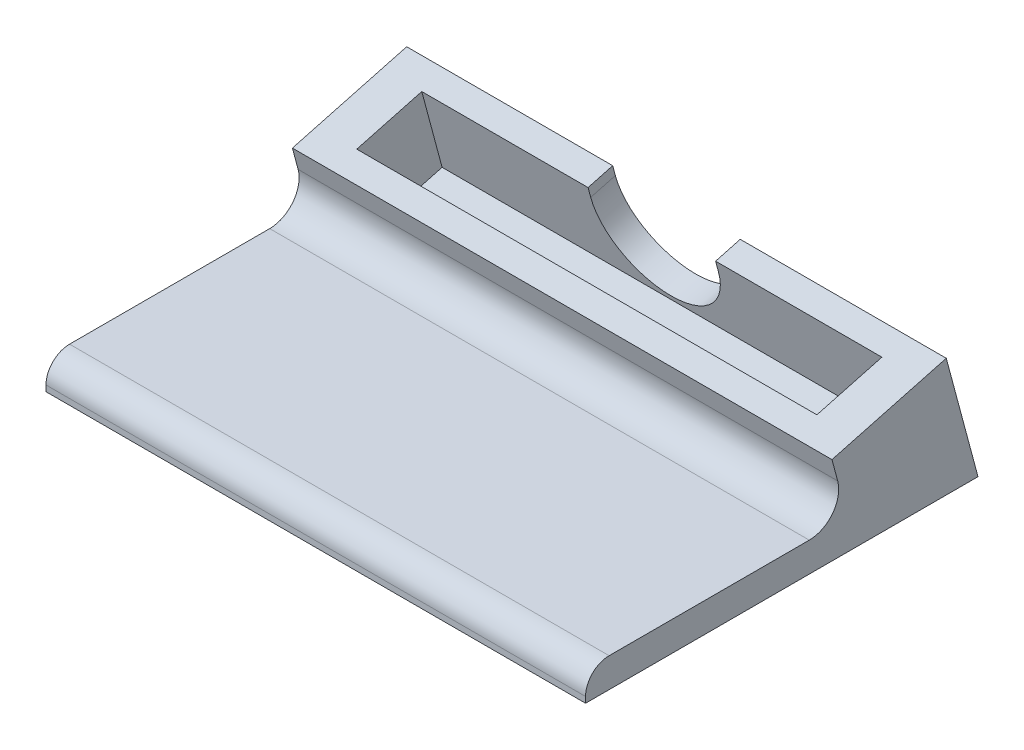
ISO-10303-21;
HEADER;
FILE_DESCRIPTION(('STEP AP214'),'2;1');
FILE_NAME('part.step','',(''),(''),'','','');
FILE_SCHEMA(('AUTOMOTIVE_DESIGN { 1 0 10303 214 1 1 1 1 }'));
ENDSEC;
DATA;
#1=APPLICATION_CONTEXT('core data for automotive mechanical design processes');
#2=APPLICATION_PROTOCOL_DEFINITION('international standard','automotive_design',2000,#1);
#3=PRODUCT_CONTEXT('',#1,'mechanical');
#4=PRODUCT('Part','Part','',(#3));
#5=PRODUCT_RELATED_PRODUCT_CATEGORY('part','',(#4));
#6=PRODUCT_DEFINITION_FORMATION('','',#4);
#7=PRODUCT_DEFINITION_CONTEXT('part definition',#1,'design');
#8=PRODUCT_DEFINITION('design','',#6,#7);
#9=PRODUCT_DEFINITION_SHAPE('','',#8);
#10=(LENGTH_UNIT() NAMED_UNIT(*) SI_UNIT(.MILLI.,.METRE.));
#11=(NAMED_UNIT(*) PLANE_ANGLE_UNIT() SI_UNIT($,.RADIAN.));
#12=(NAMED_UNIT(*) SI_UNIT($,.STERADIAN.) SOLID_ANGLE_UNIT());
#13=UNCERTAINTY_MEASURE_WITH_UNIT(LENGTH_MEASURE(1.E-05),#10,'distance_accuracy_value','');
#14=(GEOMETRIC_REPRESENTATION_CONTEXT(3) GLOBAL_UNCERTAINTY_ASSIGNED_CONTEXT((#13)) GLOBAL_UNIT_ASSIGNED_CONTEXT((#10,
#11,#12)) REPRESENTATION_CONTEXT('',''));
#15=CARTESIAN_POINT('',(0.,0.,0.));
#16=DIRECTION('',(0.,0.,1.));
#17=DIRECTION('',(1.,0.,0.));
#18=AXIS2_PLACEMENT_3D('',#15,#16,#17);
#19=CARTESIAN_POINT('',(0.,2.63407249233927,0.705797597127319));
#20=DIRECTION('',(0.,0.96592582628907,0.258819045102515));
#21=DIRECTION('',(0.,-0.258819045102515,0.96592582628907));
#22=AXIS2_PLACEMENT_3D('',#19,#20,#21);
#23=PLANE('',#22);
#24=DIRECTION('',(1.,0.,0.));
#25=VECTOR('',#24,1.);
#26=CARTESIAN_POINT('',(0.,15.334072492339,-46.6912476589975));
#27=LINE('',#26,#25);
#28=CARTESIAN_POINT('',(43.17999875,15.334072492339,-46.6912476589976));
#29=VERTEX_POINT('',#28);
#30=CARTESIAN_POINT('',(69.85,15.334072492339,-46.6912476589976));
#31=VERTEX_POINT('',#30);
#32=EDGE_CURVE('E228',#29,#31,#27,.T.);
#33=ORIENTED_EDGE('',*,*,#32,.F.);
#34=DIRECTION('',(0.,0.258819045102515,-0.96592582628907));
#35=VECTOR('',#34,1.);
#36=CARTESIAN_POINT('',(43.17999875,2.63373167087538,0.707069560146857));
#37=LINE('',#36,#35);
#38=CARTESIAN_POINT('',(43.17999875,14.4794520054105,-43.501760580591));
#39=VERTEX_POINT('',#38);
#40=EDGE_CURVE('E180',#39,#29,#37,.T.);
#41=ORIENTED_EDGE('',*,*,#40,.F.);
#42=DIRECTION('',(-1.,0.,0.));
#43=VECTOR('',#42,1.);
#44=CARTESIAN_POINT('',(5.14349999999995,14.4794520054105,-43.501760580591));
#45=LINE('',#44,#43);
#46=CARTESIAN_POINT('',(64.7065,14.4794520054105,-43.501760580591));
#47=VERTEX_POINT('',#46);
#48=EDGE_CURVE('E187',#47,#39,#45,.T.);
#49=ORIENTED_EDGE('',*,*,#48,.F.);
#50=DIRECTION('',(0.,0.258819045102514,-0.96592582628907));
#51=VECTOR('',#50,1.);
#52=CARTESIAN_POINT('',(64.7065,14.4794520054105,-43.501760580591));
#53=LINE('',#52,#51);
#54=CARTESIAN_POINT('',(64.7065,12.2245687206683,-35.0864215967954));
#55=VERTEX_POINT('',#54);
#56=EDGE_CURVE('E201',#55,#47,#53,.T.);
#57=ORIENTED_EDGE('',*,*,#56,.F.);
#58=DIRECTION('',(1.,0.,0.));
#59=VECTOR('',#58,1.);
#60=CARTESIAN_POINT('',(5.14349999999995,12.2245687206683,-35.0864215967954));
#61=LINE('',#60,#59);
#62=CARTESIAN_POINT('',(5.14349999999995,12.2245687206683,-35.0864215967954));
#63=VERTEX_POINT('',#62);
#64=EDGE_CURVE('E198',#63,#55,#61,.T.);
#65=ORIENTED_EDGE('',*,*,#64,.F.);
#66=DIRECTION('',(0.,-0.258819045102515,0.96592582628907));
#67=VECTOR('',#66,1.);
#68=CARTESIAN_POINT('',(5.14349999999995,14.4794520054105,-43.501760580591));
#69=LINE('',#68,#67);
#70=CARTESIAN_POINT('',(5.14349999999995,14.4794520054105,-43.501760580591));
#71=VERTEX_POINT('',#70);
#72=EDGE_CURVE('E165',#71,#63,#69,.T.);
#73=ORIENTED_EDGE('',*,*,#72,.F.);
#74=CARTESIAN_POINT('',(26.66999875,14.4794520054105,-43.501760580591));
#75=VERTEX_POINT('',#74);
#76=EDGE_CURVE('E204',#75,#71,#45,.T.);
#77=ORIENTED_EDGE('',*,*,#76,.F.);
#78=DIRECTION('',(0.,0.258819045102515,-0.96592582628907));
#79=VECTOR('',#78,1.);
#80=CARTESIAN_POINT('',(26.66999875,2.63373167087538,0.707069560146871));
#81=LINE('',#80,#79);
#82=CARTESIAN_POINT('',(26.66999875,15.334072492339,-46.6912476589976));
#83=VERTEX_POINT('',#82);
#84=EDGE_CURVE('E156',#75,#83,#81,.T.);
#85=ORIENTED_EDGE('',*,*,#84,.T.);
#86=CARTESIAN_POINT('',(0.,15.334072492339,-46.6912476589975));
#87=VERTEX_POINT('',#86);
#88=EDGE_CURVE('E224',#87,#83,#27,.T.);
#89=ORIENTED_EDGE('',*,*,#88,.F.);
#90=DIRECTION('',(0.,-0.258819045102515,0.96592582628907));
#91=VECTOR('',#90,1.);
#92=CARTESIAN_POINT('',(0.,2.63407249233927,0.705797597127319));
#93=LINE('',#92,#91);
#94=CARTESIAN_POINT('',(0.,11.3699482337398,-31.8969345183889));
#95=VERTEX_POINT('',#94);
#96=EDGE_CURVE('E216',#87,#95,#93,.T.);
#97=ORIENTED_EDGE('',*,*,#96,.T.);
#98=DIRECTION('',(1.,0.,0.));
#99=VECTOR('',#98,1.);
#100=CARTESIAN_POINT('',(0.,11.3699482337398,-31.8969345183889));
#101=LINE('',#100,#99);
#102=CARTESIAN_POINT('',(69.85,11.3699482337398,-31.8969345183889));
#103=VERTEX_POINT('',#102);
#104=EDGE_CURVE('E229',#95,#103,#101,.T.);
#105=ORIENTED_EDGE('',*,*,#104,.T.);
#106=DIRECTION('',(0.,-0.258819045102515,0.96592582628907));
#107=VECTOR('',#106,1.);
#108=CARTESIAN_POINT('',(69.85,2.63407249233927,0.705797597127281));
#109=LINE('',#108,#107);
#110=EDGE_CURVE('E209',#31,#103,#109,.T.);
#111=ORIENTED_EDGE('',*,*,#110,.F.);
#112=EDGE_LOOP('',(#33,#41,#49,#57,#65,#73,#77,#85,#89,#97,#105,#111));
#113=FACE_BOUND('',#112,.T.);
#114=ADVANCED_FACE('F35',(#113),#23,.T.);
#115=CARTESIAN_POINT('',(0.,12.6999999999997,-47.3970452561249));
#116=DIRECTION('',(0.,0.258819045102515,-0.96592582628907));
#117=DIRECTION('',(0.,0.96592582628907,0.258819045102515));
#118=AXIS2_PLACEMENT_3D('',#115,#116,#117);
#119=PLANE('',#118);
#120=CARTESIAN_POINT('',(34.92499875,14.0582776609764,-47.033095853769));
#121=DIRECTION('',(0.,0.258819045102515,-0.96592582628907));
#122=DIRECTION('',(0.,0.96592582628907,0.258819045102515));
#123=AXIS2_PLACEMENT_3D('',#120,#121,#122);
#124=CIRCLE('',#123,8.255);
#125=CARTESIAN_POINT('',(43.17999875,14.0582776609764,-47.033095853769));
#126=VERTEX_POINT('',#125);
#127=CARTESIAN_POINT('',(26.66999875,14.0582776609764,-47.033095853769));
#128=VERTEX_POINT('',#127);
#129=EDGE_CURVE('E153',#126,#128,#124,.T.);
#130=ORIENTED_EDGE('',*,*,#129,.F.);
#131=DIRECTION('',(0.,0.96592582628907,0.258819045102515));
#132=VECTOR('',#131,1.);
#133=CARTESIAN_POINT('',(43.17999875,12.6999999999997,-47.3970452561249));
#134=LINE('',#133,#132);
#135=EDGE_CURVE('E157',#126,#29,#134,.T.);
#136=ORIENTED_EDGE('',*,*,#135,.T.);
#137=ORIENTED_EDGE('',*,*,#32,.T.);
#138=DIRECTION('',(0.,0.96592582628907,0.258819045102515));
#139=VECTOR('',#138,1.);
#140=CARTESIAN_POINT('',(69.85,12.6999999999997,-47.3970452561249));
#141=LINE('',#140,#139);
#142=CARTESIAN_POINT('',(69.85,0.,-50.8));
#143=VERTEX_POINT('',#142);
#144=EDGE_CURVE('E220',#143,#31,#141,.T.);
#145=ORIENTED_EDGE('',*,*,#144,.F.);
#146=DIRECTION('',(-1.,0.,0.));
#147=VECTOR('',#146,1.);
#148=CARTESIAN_POINT('',(0.,0.,-50.8));
#149=LINE('',#148,#147);
#150=CARTESIAN_POINT('',(-2.50000002775557E-06,0.,-50.8));
#151=VERTEX_POINT('',#150);
#152=EDGE_CURVE('E242',#143,#151,#149,.T.);
#153=ORIENTED_EDGE('',*,*,#152,.T.);
#154=DIRECTION('',(0.,0.96592582628907,0.258819045102515));
#155=VECTOR('',#154,1.);
#156=CARTESIAN_POINT('',(0.,12.6999999999997,-47.3970452561249));
#157=LINE('',#156,#155);
#158=EDGE_CURVE('E231',#151,#87,#157,.T.);
#159=ORIENTED_EDGE('',*,*,#158,.T.);
#160=ORIENTED_EDGE('',*,*,#88,.T.);
#161=DIRECTION('',(0.,0.96592582628907,0.258819045102515));
#162=VECTOR('',#161,1.);
#163=CARTESIAN_POINT('',(26.66999875,12.6999999999997,-47.3970452561249));
#164=LINE('',#163,#162);
#165=EDGE_CURVE('E175',#128,#83,#164,.T.);
#166=ORIENTED_EDGE('',*,*,#165,.F.);
#167=EDGE_LOOP('',(#130,#136,#137,#145,#153,#159,#160,#166));
#168=FACE_BOUND('',#167,.T.);
#169=ADVANCED_FACE('F283',(#168),#119,.T.);
#170=CARTESIAN_POINT('',(5.14349999999995,4.66564561031352,-46.1313620788326));
#171=DIRECTION('',(0.,0.258819045102515,-0.96592582628907));
#172=DIRECTION('',(0.,0.96592582628907,0.258819045102515));
#173=AXIS2_PLACEMENT_3D('',#170,#171,#172);
#174=PLANE('',#173);
#175=DIRECTION('',(0.,-0.96592582628907,-0.258819045102515));
#176=VECTOR('',#175,1.);
#177=CARTESIAN_POINT('',(43.17999875,11.8453795130712,-44.2075581777184));
#178=LINE('',#177,#176);
#179=CARTESIAN_POINT('',(43.17999875,13.2036571740479,-43.8436087753624));
#180=VERTEX_POINT('',#179);
#181=EDGE_CURVE('E170',#39,#180,#178,.T.);
#182=ORIENTED_EDGE('',*,*,#181,.T.);
#183=CARTESIAN_POINT('',(34.92499875,13.2036571740479,-43.8436087753624));
#184=DIRECTION('',(0.,0.258819045102515,-0.96592582628907));
#185=DIRECTION('',(0.,0.96592582628907,0.258819045102515));
#186=AXIS2_PLACEMENT_3D('',#183,#184,#185);
#187=CIRCLE('',#186,8.255);
#188=CARTESIAN_POINT('',(26.66999875,13.2036571740479,-43.8436087753624));
#189=VERTEX_POINT('',#188);
#190=EDGE_CURVE('E150',#189,#180,#187,.F.);
#191=ORIENTED_EDGE('',*,*,#190,.F.);
#192=DIRECTION('',(0.,-0.96592582628907,-0.258819045102515));
#193=VECTOR('',#192,1.);
#194=CARTESIAN_POINT('',(26.66999875,11.8453795130712,-44.2075581777184));
#195=LINE('',#194,#193);
#196=EDGE_CURVE('E160',#75,#189,#195,.T.);
#197=ORIENTED_EDGE('',*,*,#196,.F.);
#198=ORIENTED_EDGE('',*,*,#76,.T.);
#199=DIRECTION('',(0.,0.96592582628907,0.258819045102515));
#200=VECTOR('',#199,1.);
#201=CARTESIAN_POINT('',(5.14349999999995,4.66564561031352,-46.1313620788326));
#202=LINE('',#201,#200);
#203=CARTESIAN_POINT('',(5.14349999999995,4.66564561031352,-46.1313620788326));
#204=VERTEX_POINT('',#203);
#205=EDGE_CURVE('E206',#204,#71,#202,.T.);
#206=ORIENTED_EDGE('',*,*,#205,.F.);
#207=DIRECTION('',(-1.,0.,0.));
#208=VECTOR('',#207,1.);
#209=CARTESIAN_POINT('',(5.14349999999995,4.66564561031352,-46.1313620788326));
#210=LINE('',#209,#208);
#211=CARTESIAN_POINT('',(64.7065,4.66564561031351,-46.1313620788326));
#212=VERTEX_POINT('',#211);
#213=EDGE_CURVE('E193',#212,#204,#210,.T.);
#214=ORIENTED_EDGE('',*,*,#213,.F.);
#215=DIRECTION('',(0.,0.96592582628907,0.258819045102515));
#216=VECTOR('',#215,1.);
#217=CARTESIAN_POINT('',(64.7065,4.66564561031351,-46.1313620788326));
#218=LINE('',#217,#216);
#219=EDGE_CURVE('E210',#212,#47,#218,.T.);
#220=ORIENTED_EDGE('',*,*,#219,.T.);
#221=ORIENTED_EDGE('',*,*,#48,.T.);
#222=EDGE_LOOP('',(#182,#191,#197,#198,#206,#214,#220,#221));
#223=FACE_BOUND('',#222,.T.);
#224=ADVANCED_FACE('F168',(#223),#174,.F.);
#225=CARTESIAN_POINT('',(0.,3.81,0.));
#226=DIRECTION('',(0.,-1.,0.));
#227=DIRECTION('',(0.,0.,-1.));
#228=AXIS2_PLACEMENT_3D('',#225,#226,#227);
#229=PLANE('',#228);
#230=DIRECTION('',(0.,0.,1.));
#231=VECTOR('',#230,1.);
#232=CARTESIAN_POINT('',(0.,3.81,0.));
#233=LINE('',#232,#231);
#234=CARTESIAN_POINT('',(0.,3.81,-28.9573278719156));
#235=VERTEX_POINT('',#234);
#236=CARTESIAN_POINT('',(0.,3.81,-3.048));
#237=VERTEX_POINT('',#236);
#238=EDGE_CURVE('E237',#235,#237,#233,.T.);
#239=ORIENTED_EDGE('',*,*,#238,.T.);
#240=DIRECTION('',(1.,0.,0.));
#241=VECTOR('',#240,1.);
#242=CARTESIAN_POINT('',(0.,3.81,-3.048));
#243=LINE('',#242,#241);
#244=CARTESIAN_POINT('',(69.85,3.81,-3.048));
#245=VERTEX_POINT('',#244);
#246=EDGE_CURVE('E252',#237,#245,#243,.T.);
#247=ORIENTED_EDGE('',*,*,#246,.T.);
#248=DIRECTION('',(0.,0.,-1.));
#249=VECTOR('',#248,1.);
#250=CARTESIAN_POINT('',(69.85,3.81,0.));
#251=LINE('',#250,#249);
#252=CARTESIAN_POINT('',(69.85,3.81,-28.9573278719156));
#253=VERTEX_POINT('',#252);
#254=EDGE_CURVE('E241',#245,#253,#251,.T.);
#255=ORIENTED_EDGE('',*,*,#254,.T.);
#256=DIRECTION('',(1.,0.,0.));
#257=VECTOR('',#256,1.);
#258=CARTESIAN_POINT('',(0.,3.81,-28.9573278719156));
#259=LINE('',#258,#257);
#260=EDGE_CURVE('E245',#253,#235,#259,.F.);
#261=ORIENTED_EDGE('',*,*,#260,.T.);
#262=EDGE_LOOP('',(#239,#247,#255,#261));
#263=FACE_BOUND('',#262,.T.);
#264=ADVANCED_FACE('F259',(#263),#229,.F.);
#265=CARTESIAN_POINT('',(0.,3.81,0.));
#266=DIRECTION('',(1.,0.,0.));
#267=DIRECTION('',(0.,0.,-1.));
#268=AXIS2_PLACEMENT_3D('',#265,#266,#267);
#269=PLANE('',#268);
#270=DIRECTION('',(0.,-1.,0.));
#271=VECTOR('',#270,1.);
#272=CARTESIAN_POINT('',(0.,3.81,0.));
#273=LINE('',#272,#271);
#274=CARTESIAN_POINT('',(0.,0.762000000000001,0.));
#275=VERTEX_POINT('',#274);
#276=CARTESIAN_POINT('',(0.,0.,0.));
#277=VERTEX_POINT('',#276);
#278=EDGE_CURVE('E277',#275,#277,#273,.T.);
#279=ORIENTED_EDGE('',*,*,#278,.F.);
#280=CARTESIAN_POINT('',(0.,0.762,-3.048));
#281=DIRECTION('',(1.,0.,0.));
#282=DIRECTION('',(0.,0.,-1.));
#283=AXIS2_PLACEMENT_3D('',#280,#281,#282);
#284=CIRCLE('',#283,3.048);
#285=EDGE_CURVE('E11',#275,#237,#284,.F.);
#286=ORIENTED_EDGE('',*,*,#285,.T.);
#287=ORIENTED_EDGE('',*,*,#238,.F.);
#288=CARTESIAN_POINT('',(0.,7.62,-28.9573278719156));
#289=DIRECTION('',(1.,0.,0.));
#290=DIRECTION('',(0.,0.,-1.));
#291=AXIS2_PLACEMENT_3D('',#288,#289,#290);
#292=CIRCLE('',#291,3.81);
#293=CARTESIAN_POINT('',(0.,8.60610056184058,-32.6375052700769));
#294=VERTEX_POINT('',#293);
#295=EDGE_CURVE('E250',#235,#294,#292,.T.);
#296=ORIENTED_EDGE('',*,*,#295,.T.);
#297=DIRECTION('',(0.,-0.96592582628907,-0.258819045102515));
#298=VECTOR('',#297,1.);
#299=CARTESIAN_POINT('',(0.,8.73587574140059,-32.6027321155162));
#300=LINE('',#299,#298);
#301=EDGE_CURVE('E219',#95,#294,#300,.T.);
#302=ORIENTED_EDGE('',*,*,#301,.F.);
#303=ORIENTED_EDGE('',*,*,#96,.F.);
#304=ORIENTED_EDGE('',*,*,#158,.F.);
#305=DIRECTION('',(0.,0.,1.));
#306=VECTOR('',#305,1.);
#307=CARTESIAN_POINT('',(0.,0.,0.));
#308=LINE('',#307,#306);
#309=EDGE_CURVE('E227',#151,#277,#308,.T.);
#310=ORIENTED_EDGE('',*,*,#309,.T.);
#311=EDGE_LOOP('',(#279,#286,#287,#296,#302,#303,#304,#310));
#312=FACE_BOUND('',#311,.T.);
#313=ADVANCED_FACE('F273',(#312),#269,.F.);
#314=CARTESIAN_POINT('',(0.,3.81,0.));
#315=DIRECTION('',(0.,0.,-1.));
#316=DIRECTION('',(-1.,0.,0.));
#317=AXIS2_PLACEMENT_3D('',#314,#315,#316);
#318=PLANE('',#317);
#319=DIRECTION('',(0.,-1.,0.));
#320=VECTOR('',#319,1.);
#321=CARTESIAN_POINT('',(69.85,3.81,0.));
#322=LINE('',#321,#320);
#323=CARTESIAN_POINT('',(69.85,0.762000000000001,0.));
#324=VERTEX_POINT('',#323);
#325=CARTESIAN_POINT('',(69.85,0.,0.));
#326=VERTEX_POINT('',#325);
#327=EDGE_CURVE('E254',#324,#326,#322,.T.);
#328=ORIENTED_EDGE('',*,*,#327,.F.);
#329=DIRECTION('',(1.,0.,0.));
#330=VECTOR('',#329,1.);
#331=CARTESIAN_POINT('',(0.,0.762,0.));
#332=LINE('',#331,#330);
#333=EDGE_CURVE('E43',#324,#275,#332,.F.);
#334=ORIENTED_EDGE('',*,*,#333,.T.);
#335=ORIENTED_EDGE('',*,*,#278,.T.);
#336=DIRECTION('',(1.,0.,0.));
#337=VECTOR('',#336,1.);
#338=CARTESIAN_POINT('',(0.,0.,0.));
#339=LINE('',#338,#337);
#340=EDGE_CURVE('E477',#277,#326,#339,.T.);
#341=ORIENTED_EDGE('',*,*,#340,.T.);
#342=EDGE_LOOP('',(#328,#334,#335,#341));
#343=FACE_BOUND('',#342,.T.);
#344=ADVANCED_FACE('F303',(#343),#318,.F.);
#345=CARTESIAN_POINT('',(69.85,3.81,0.));
#346=DIRECTION('',(-1.,0.,0.));
#347=DIRECTION('',(0.,0.,1.));
#348=AXIS2_PLACEMENT_3D('',#345,#346,#347);
#349=PLANE('',#348);
#350=ORIENTED_EDGE('',*,*,#254,.F.);
#351=CARTESIAN_POINT('',(69.85,0.762,-3.048));
#352=DIRECTION('',(-1.,0.,0.));
#353=DIRECTION('',(0.,0.,1.));
#354=AXIS2_PLACEMENT_3D('',#351,#352,#353);
#355=CIRCLE('',#354,3.048);
#356=EDGE_CURVE('E57',#245,#324,#355,.F.);
#357=ORIENTED_EDGE('',*,*,#356,.T.);
#358=ORIENTED_EDGE('',*,*,#327,.T.);
#359=DIRECTION('',(0.,0.,-1.));
#360=VECTOR('',#359,1.);
#361=CARTESIAN_POINT('',(69.85,0.,0.));
#362=LINE('',#361,#360);
#363=EDGE_CURVE('E455',#326,#143,#362,.T.);
#364=ORIENTED_EDGE('',*,*,#363,.T.);
#365=ORIENTED_EDGE('',*,*,#144,.T.);
#366=ORIENTED_EDGE('',*,*,#110,.T.);
#367=DIRECTION('',(0.,-0.96592582628907,-0.258819045102515));
#368=VECTOR('',#367,1.);
#369=CARTESIAN_POINT('',(69.85,8.73587574140059,-32.6027321155163));
#370=LINE('',#369,#368);
#371=CARTESIAN_POINT('',(69.85,8.60610056184058,-32.637505270077));
#372=VERTEX_POINT('',#371);
#373=EDGE_CURVE('E223',#103,#372,#370,.T.);
#374=ORIENTED_EDGE('',*,*,#373,.T.);
#375=CARTESIAN_POINT('',(69.85,7.62,-28.9573278719156));
#376=DIRECTION('',(-1.,0.,0.));
#377=DIRECTION('',(0.,0.,1.));
#378=AXIS2_PLACEMENT_3D('',#375,#376,#377);
#379=CIRCLE('',#378,3.81);
#380=EDGE_CURVE('E247',#372,#253,#379,.T.);
#381=ORIENTED_EDGE('',*,*,#380,.T.);
#382=EDGE_LOOP('',(#350,#357,#358,#364,#365,#366,#374,#381));
#383=FACE_BOUND('',#382,.T.);
#384=ADVANCED_FACE('F263',(#383),#349,.F.);
#385=CARTESIAN_POINT('',(0.,0.,0.));
#386=DIRECTION('',(0.,-1.,0.));
#387=DIRECTION('',(0.,0.,-1.));
#388=AXIS2_PLACEMENT_3D('',#385,#386,#387);
#389=PLANE('',#388);
#390=ORIENTED_EDGE('',*,*,#309,.F.);
#391=ORIENTED_EDGE('',*,*,#152,.F.);
#392=ORIENTED_EDGE('',*,*,#363,.F.);
#393=ORIENTED_EDGE('',*,*,#340,.F.);
#394=EDGE_LOOP('',(#390,#391,#392,#393));
#395=FACE_BOUND('',#394,.T.);
#396=ADVANCED_FACE('F297',(#395),#389,.T.);
#397=CARTESIAN_POINT('',(0.,8.73587574140059,-32.6027321155162));
#398=DIRECTION('',(0.,-0.258819045102515,0.96592582628907));
#399=DIRECTION('',(0.,-0.96592582628907,-0.258819045102515));
#400=AXIS2_PLACEMENT_3D('',#397,#398,#399);
#401=PLANE('',#400);
#402=ORIENTED_EDGE('',*,*,#301,.T.);
#403=DIRECTION('',(1.,0.,0.));
#404=VECTOR('',#403,1.);
#405=CARTESIAN_POINT('',(0.,8.60610056184058,-32.6375052700769));
#406=LINE('',#405,#404);
#407=EDGE_CURVE('E243',#294,#372,#406,.T.);
#408=ORIENTED_EDGE('',*,*,#407,.T.);
#409=ORIENTED_EDGE('',*,*,#373,.F.);
#410=ORIENTED_EDGE('',*,*,#104,.F.);
#411=EDGE_LOOP('',(#402,#408,#409,#410));
#412=FACE_BOUND('',#411,.T.);
#413=ADVANCED_FACE('F294',(#412),#401,.T.);
#414=CARTESIAN_POINT('',(5.14349999999995,4.66564561031352,-46.1313620788326));
#415=DIRECTION('',(-1.,0.,0.));
#416=DIRECTION('',(0.,-1.,0.));
#417=AXIS2_PLACEMENT_3D('',#414,#415,#416);
#418=PLANE('',#417);
#419=ORIENTED_EDGE('',*,*,#72,.T.);
#420=DIRECTION('',(0.,0.96592582628907,0.258819045102515));
#421=VECTOR('',#420,1.);
#422=CARTESIAN_POINT('',(5.14349999999995,2.41076232557139,-37.716023095037));
#423=LINE('',#422,#421);
#424=CARTESIAN_POINT('',(5.14349999999995,2.41076232557139,-37.716023095037));
#425=VERTEX_POINT('',#424);
#426=EDGE_CURVE('E196',#425,#63,#423,.T.);
#427=ORIENTED_EDGE('',*,*,#426,.F.);
#428=DIRECTION('',(0.,-0.258819045102515,0.96592582628907));
#429=VECTOR('',#428,1.);
#430=CARTESIAN_POINT('',(5.14349999999995,4.66564561031352,-46.1313620788326));
#431=LINE('',#430,#429);
#432=EDGE_CURVE('E183',#204,#425,#431,.T.);
#433=ORIENTED_EDGE('',*,*,#432,.F.);
#434=ORIENTED_EDGE('',*,*,#205,.T.);
#435=EDGE_LOOP('',(#419,#427,#433,#434));
#436=FACE_BOUND('',#435,.T.);
#437=ADVANCED_FACE('F331',(#436),#418,.F.);
#438=CARTESIAN_POINT('',(64.7065,4.66564561031351,-46.1313620788326));
#439=DIRECTION('',(1.,0.,0.));
#440=DIRECTION('',(0.,1.,0.));
#441=AXIS2_PLACEMENT_3D('',#438,#439,#440);
#442=PLANE('',#441);
#443=ORIENTED_EDGE('',*,*,#56,.T.);
#444=ORIENTED_EDGE('',*,*,#219,.F.);
#445=DIRECTION('',(0.,0.258819045102514,-0.96592582628907));
#446=VECTOR('',#445,1.);
#447=CARTESIAN_POINT('',(64.7065,4.66564561031351,-46.1313620788326));
#448=LINE('',#447,#446);
#449=CARTESIAN_POINT('',(64.7065,2.41076232557139,-37.716023095037));
#450=VERTEX_POINT('',#449);
#451=EDGE_CURVE('E190',#450,#212,#448,.T.);
#452=ORIENTED_EDGE('',*,*,#451,.F.);
#453=DIRECTION('',(0.,0.96592582628907,0.258819045102515));
#454=VECTOR('',#453,1.);
#455=CARTESIAN_POINT('',(64.7065,2.41076232557139,-37.716023095037));
#456=LINE('',#455,#454);
#457=EDGE_CURVE('E212',#450,#55,#456,.T.);
#458=ORIENTED_EDGE('',*,*,#457,.T.);
#459=EDGE_LOOP('',(#443,#444,#452,#458));
#460=FACE_BOUND('',#459,.T.);
#461=ADVANCED_FACE('F339',(#460),#442,.F.);
#462=CARTESIAN_POINT('',(5.14349999999995,2.41076232557139,-37.716023095037));
#463=DIRECTION('',(0.,-0.258819045102515,0.96592582628907));
#464=DIRECTION('',(0.,-0.96592582628907,-0.258819045102515));
#465=AXIS2_PLACEMENT_3D('',#462,#463,#464);
#466=PLANE('',#465);
#467=ORIENTED_EDGE('',*,*,#64,.T.);
#468=ORIENTED_EDGE('',*,*,#457,.F.);
#469=DIRECTION('',(1.,0.,0.));
#470=VECTOR('',#469,1.);
#471=CARTESIAN_POINT('',(5.14349999999995,2.41076232557139,-37.716023095037));
#472=LINE('',#471,#470);
#473=EDGE_CURVE('E186',#425,#450,#472,.T.);
#474=ORIENTED_EDGE('',*,*,#473,.F.);
#475=ORIENTED_EDGE('',*,*,#426,.T.);
#476=EDGE_LOOP('',(#467,#468,#474,#475));
#477=FACE_BOUND('',#476,.T.);
#478=ADVANCED_FACE('F347',(#477),#466,.F.);
#479=CARTESIAN_POINT('',(0.,-7.17973390275769,-1.92380390111423));
#480=DIRECTION('',(0.,0.96592582628907,0.258819045102515));
#481=DIRECTION('',(0.,-0.258819045102515,0.96592582628907));
#482=AXIS2_PLACEMENT_3D('',#479,#480,#481);
#483=PLANE('',#482);
#484=ORIENTED_EDGE('',*,*,#432,.T.);
#485=ORIENTED_EDGE('',*,*,#473,.T.);
#486=ORIENTED_EDGE('',*,*,#451,.T.);
#487=ORIENTED_EDGE('',*,*,#213,.T.);
#488=EDGE_LOOP('',(#484,#485,#486,#487));
#489=FACE_BOUND('',#488,.T.);
#490=ADVANCED_FACE('F355',(#489),#483,.T.);
#491=CARTESIAN_POINT('',(34.92499875,1.35793683951276,0.365221365375458));
#492=DIRECTION('',(0.,0.258819045102515,-0.96592582628907));
#493=DIRECTION('',(0.,0.96592582628907,0.258819045102515));
#494=AXIS2_PLACEMENT_3D('',#491,#492,#493);
#495=CYLINDRICAL_SURFACE('',#494,8.255);
#496=ORIENTED_EDGE('',*,*,#190,.T.);
#497=DIRECTION('',(0.,0.258819045102515,-0.96592582628907));
#498=VECTOR('',#497,1.);
#499=CARTESIAN_POINT('',(43.17999875,1.35793683951276,0.365221365375451));
#500=LINE('',#499,#498);
#501=EDGE_CURVE('E166',#180,#126,#500,.T.);
#502=ORIENTED_EDGE('',*,*,#501,.T.);
#503=ORIENTED_EDGE('',*,*,#129,.T.);
#504=DIRECTION('',(0.,0.258819045102515,-0.96592582628907));
#505=VECTOR('',#504,1.);
#506=CARTESIAN_POINT('',(26.66999875,1.35793683951276,0.365221365375465));
#507=LINE('',#506,#505);
#508=EDGE_CURVE('E146',#189,#128,#507,.T.);
#509=ORIENTED_EDGE('',*,*,#508,.F.);
#510=EDGE_LOOP('',(#496,#502,#503,#509));
#511=FACE_BOUND('',#510,.T.);
#512=ADVANCED_FACE('F148',(#511),#495,.F.);
#513=CARTESIAN_POINT('',(43.17999875,-0.000340821463887947,0.00127196301953625));
#514=DIRECTION('',(-1.,0.,0.));
#515=DIRECTION('',(0.,0.,1.));
#516=AXIS2_PLACEMENT_3D('',#513,#514,#515);
#517=PLANE('',#516);
#518=ORIENTED_EDGE('',*,*,#40,.T.);
#519=ORIENTED_EDGE('',*,*,#135,.F.);
#520=ORIENTED_EDGE('',*,*,#501,.F.);
#521=ORIENTED_EDGE('',*,*,#181,.F.);
#522=EDGE_LOOP('',(#518,#519,#520,#521));
#523=FACE_BOUND('',#522,.T.);
#524=ADVANCED_FACE('F370',(#523),#517,.T.);
#525=CARTESIAN_POINT('',(26.66999875,-0.000340821463908764,0.00127196301953625));
#526=DIRECTION('',(-1.,0.,0.));
#527=DIRECTION('',(0.,0.,1.));
#528=AXIS2_PLACEMENT_3D('',#525,#526,#527);
#529=PLANE('',#528);
#530=ORIENTED_EDGE('',*,*,#196,.T.);
#531=ORIENTED_EDGE('',*,*,#508,.T.);
#532=ORIENTED_EDGE('',*,*,#165,.T.);
#533=ORIENTED_EDGE('',*,*,#84,.F.);
#534=EDGE_LOOP('',(#530,#531,#532,#533));
#535=FACE_BOUND('',#534,.T.);
#536=ADVANCED_FACE('F161',(#535),#529,.F.);
#537=CARTESIAN_POINT('',(0.,7.62,-28.9573278719156));
#538=DIRECTION('',(1.,0.,0.));
#539=DIRECTION('',(0.,0.,-1.));
#540=AXIS2_PLACEMENT_3D('',#537,#538,#539);
#541=CYLINDRICAL_SURFACE('',#540,3.81);
#542=ORIENTED_EDGE('',*,*,#295,.F.);
#543=ORIENTED_EDGE('',*,*,#260,.F.);
#544=ORIENTED_EDGE('',*,*,#380,.F.);
#545=ORIENTED_EDGE('',*,*,#407,.F.);
#546=EDGE_LOOP('',(#542,#543,#544,#545));
#547=FACE_BOUND('',#546,.T.);
#548=ADVANCED_FACE('F271',(#547),#541,.F.);
#549=CARTESIAN_POINT('',(0.,0.762,-3.048));
#550=DIRECTION('',(1.,0.,0.));
#551=DIRECTION('',(0.,0.,-1.));
#552=AXIS2_PLACEMENT_3D('',#549,#550,#551);
#553=CYLINDRICAL_SURFACE('',#552,3.048);
#554=ORIENTED_EDGE('',*,*,#285,.F.);
#555=ORIENTED_EDGE('',*,*,#333,.F.);
#556=ORIENTED_EDGE('',*,*,#356,.F.);
#557=ORIENTED_EDGE('',*,*,#246,.F.);
#558=EDGE_LOOP('',(#554,#555,#556,#557));
#559=FACE_BOUND('',#558,.T.);
#560=ADVANCED_FACE('F37',(#559),#553,.T.);
#561=CLOSED_SHELL('',(#114,#169,#224,#264,#313,#344,#384,#396,#413,#437,#461,#478,#490,#512,
#524,#536,#548,#560));
#562=MANIFOLD_SOLID_BREP('B2',#561);
#563=ADVANCED_BREP_SHAPE_REPRESENTATION('',(#18,#562),#14);
#564=SHAPE_DEFINITION_REPRESENTATION(#9,#563);
ENDSEC;
END-ISO-10303-21;
